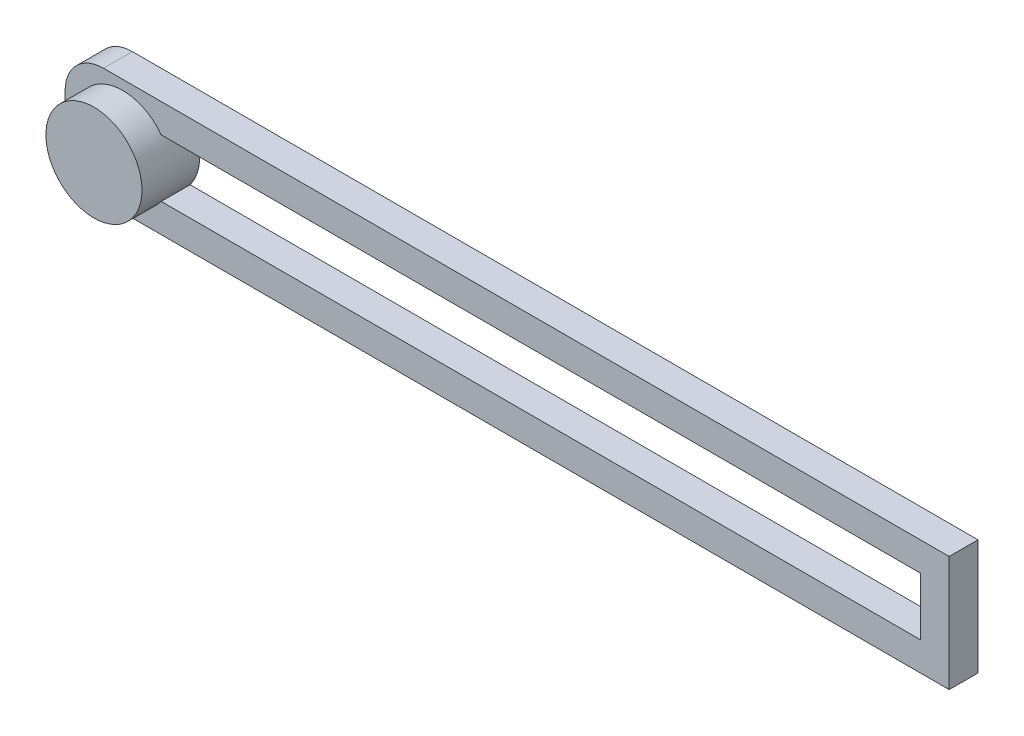
ISO-10303-21;
HEADER;
FILE_DESCRIPTION(('STEP AP214'),'2;1');
FILE_NAME('part.step','',(''),(''),'','','');
FILE_SCHEMA(('AUTOMOTIVE_DESIGN { 1 0 10303 214 1 1 1 1 }'));
ENDSEC;
DATA;
#1=APPLICATION_CONTEXT('core data for automotive mechanical design processes');
#2=APPLICATION_PROTOCOL_DEFINITION('international standard','automotive_design',2000,#1);
#3=PRODUCT_CONTEXT('',#1,'mechanical');
#4=PRODUCT('Part','Part','',(#3));
#5=PRODUCT_RELATED_PRODUCT_CATEGORY('part','',(#4));
#6=PRODUCT_DEFINITION_FORMATION('','',#4);
#7=PRODUCT_DEFINITION_CONTEXT('part definition',#1,'design');
#8=PRODUCT_DEFINITION('design','',#6,#7);
#9=PRODUCT_DEFINITION_SHAPE('','',#8);
#10=(LENGTH_UNIT() NAMED_UNIT(*) SI_UNIT(.MILLI.,.METRE.));
#11=(NAMED_UNIT(*) PLANE_ANGLE_UNIT() SI_UNIT($,.RADIAN.));
#12=(NAMED_UNIT(*) SI_UNIT($,.STERADIAN.) SOLID_ANGLE_UNIT());
#13=UNCERTAINTY_MEASURE_WITH_UNIT(LENGTH_MEASURE(1.E-05),#10,'distance_accuracy_value','');
#14=(GEOMETRIC_REPRESENTATION_CONTEXT(3) GLOBAL_UNCERTAINTY_ASSIGNED_CONTEXT((#13)) GLOBAL_UNIT_ASSIGNED_CONTEXT((#10,
#11,#12)) REPRESENTATION_CONTEXT('',''));
#15=CARTESIAN_POINT('',(0.,0.,0.));
#16=DIRECTION('',(0.,0.,1.));
#17=DIRECTION('',(1.,0.,0.));
#18=AXIS2_PLACEMENT_3D('',#15,#16,#17);
#19=CARTESIAN_POINT('',(46.,-6.,3.));
#20=DIRECTION('',(-1.,0.,0.));
#21=DIRECTION('',(0.,0.,1.));
#22=AXIS2_PLACEMENT_3D('',#19,#20,#21);
#23=PLANE('',#22);
#24=DIRECTION('',(0.,1.,0.));
#25=VECTOR('',#24,1.);
#26=CARTESIAN_POINT('',(46.,-6.,0.));
#27=LINE('',#26,#25);
#28=CARTESIAN_POINT('',(46.,-6.,0.));
#29=VERTEX_POINT('',#28);
#30=CARTESIAN_POINT('',(46.,6.,0.));
#31=VERTEX_POINT('',#30);
#32=EDGE_CURVE('E164',#29,#31,#27,.T.);
#33=ORIENTED_EDGE('',*,*,#32,.T.);
#34=DIRECTION('',(0.,0.,-1.));
#35=VECTOR('',#34,1.);
#36=CARTESIAN_POINT('',(46.,6.,3.));
#37=LINE('',#36,#35);
#38=CARTESIAN_POINT('',(46.,6.,3.));
#39=VERTEX_POINT('',#38);
#40=EDGE_CURVE('E186',#39,#31,#37,.T.);
#41=ORIENTED_EDGE('',*,*,#40,.F.);
#42=DIRECTION('',(0.,1.,0.));
#43=VECTOR('',#42,1.);
#44=CARTESIAN_POINT('',(46.,-6.,3.));
#45=LINE('',#44,#43);
#46=CARTESIAN_POINT('',(46.,-6.,3.));
#47=VERTEX_POINT('',#46);
#48=EDGE_CURVE('E166',#47,#39,#45,.T.);
#49=ORIENTED_EDGE('',*,*,#48,.F.);
#50=DIRECTION('',(0.,0.,-1.));
#51=VECTOR('',#50,1.);
#52=CARTESIAN_POINT('',(46.,-6.,3.));
#53=LINE('',#52,#51);
#54=EDGE_CURVE('E176',#47,#29,#53,.T.);
#55=ORIENTED_EDGE('',*,*,#54,.T.);
#56=EDGE_LOOP('',(#33,#41,#49,#55));
#57=FACE_BOUND('',#56,.T.);
#58=ADVANCED_FACE('F45',(#57),#23,.F.);
#59=CARTESIAN_POINT('',(-46.,6.,3.));
#60=DIRECTION('',(0.,-1.,0.));
#61=DIRECTION('',(0.,0.,-1.));
#62=AXIS2_PLACEMENT_3D('',#59,#60,#61);
#63=PLANE('',#62);
#64=DIRECTION('',(-1.,0.,0.));
#65=VECTOR('',#64,1.);
#66=CARTESIAN_POINT('',(-46.,6.,0.));
#67=LINE('',#66,#65);
#68=CARTESIAN_POINT('',(-42.,6.,0.));
#69=VERTEX_POINT('',#68);
#70=EDGE_CURVE('E179',#31,#69,#67,.T.);
#71=ORIENTED_EDGE('',*,*,#70,.T.);
#72=DIRECTION('',(0.,0.,-1.));
#73=VECTOR('',#72,1.);
#74=CARTESIAN_POINT('',(-42.,6.,3.));
#75=LINE('',#74,#73);
#76=CARTESIAN_POINT('',(-42.,6.,3.));
#77=VERTEX_POINT('',#76);
#78=EDGE_CURVE('E53',#69,#77,#75,.F.);
#79=ORIENTED_EDGE('',*,*,#78,.T.);
#80=DIRECTION('',(-1.,0.,0.));
#81=VECTOR('',#80,1.);
#82=CARTESIAN_POINT('',(-46.,6.,3.));
#83=LINE('',#82,#81);
#84=EDGE_CURVE('E169',#39,#77,#83,.T.);
#85=ORIENTED_EDGE('',*,*,#84,.F.);
#86=ORIENTED_EDGE('',*,*,#40,.T.);
#87=EDGE_LOOP('',(#71,#79,#85,#86));
#88=FACE_BOUND('',#87,.T.);
#89=ADVANCED_FACE('F221',(#88),#63,.F.);
#90=CARTESIAN_POINT('',(-46.,-6.,3.));
#91=DIRECTION('',(1.,0.,0.));
#92=DIRECTION('',(0.,0.,-1.));
#93=AXIS2_PLACEMENT_3D('',#90,#91,#92);
#94=PLANE('',#93);
#95=DIRECTION('',(0.,-1.,0.));
#96=VECTOR('',#95,1.);
#97=CARTESIAN_POINT('',(-46.,-6.,0.));
#98=LINE('',#97,#96);
#99=CARTESIAN_POINT('',(-46.,2.,0.));
#100=VERTEX_POINT('',#99);
#101=CARTESIAN_POINT('',(-46.,-2.,0.));
#102=VERTEX_POINT('',#101);
#103=EDGE_CURVE('E181',#100,#102,#98,.T.);
#104=ORIENTED_EDGE('',*,*,#103,.T.);
#105=DIRECTION('',(0.,0.,-1.));
#106=VECTOR('',#105,1.);
#107=CARTESIAN_POINT('',(-46.,-2.,3.));
#108=LINE('',#107,#106);
#109=CARTESIAN_POINT('',(-46.,-2.,3.));
#110=VERTEX_POINT('',#109);
#111=EDGE_CURVE('E67',#102,#110,#108,.F.);
#112=ORIENTED_EDGE('',*,*,#111,.T.);
#113=DIRECTION('',(0.,-1.,0.));
#114=VECTOR('',#113,1.);
#115=CARTESIAN_POINT('',(-46.,-6.,3.));
#116=LINE('',#115,#114);
#117=CARTESIAN_POINT('',(-46.,2.,3.));
#118=VERTEX_POINT('',#117);
#119=EDGE_CURVE('E172',#118,#110,#116,.T.);
#120=ORIENTED_EDGE('',*,*,#119,.F.);
#121=DIRECTION('',(0.,0.,-1.));
#122=VECTOR('',#121,1.);
#123=CARTESIAN_POINT('',(-46.,2.,3.));
#124=LINE('',#123,#122);
#125=EDGE_CURVE('E196',#118,#100,#124,.T.);
#126=ORIENTED_EDGE('',*,*,#125,.T.);
#127=EDGE_LOOP('',(#104,#112,#120,#126));
#128=FACE_BOUND('',#127,.T.);
#129=ADVANCED_FACE('F217',(#128),#94,.F.);
#130=CARTESIAN_POINT('',(-46.,-6.,3.));
#131=DIRECTION('',(0.,1.,0.));
#132=DIRECTION('',(0.,0.,1.));
#133=AXIS2_PLACEMENT_3D('',#130,#131,#132);
#134=PLANE('',#133);
#135=DIRECTION('',(1.,0.,0.));
#136=VECTOR('',#135,1.);
#137=CARTESIAN_POINT('',(-46.,-6.,3.));
#138=LINE('',#137,#136);
#139=CARTESIAN_POINT('',(-42.,-6.,3.));
#140=VERTEX_POINT('',#139);
#141=EDGE_CURVE('E174',#140,#47,#138,.T.);
#142=ORIENTED_EDGE('',*,*,#141,.F.);
#143=DIRECTION('',(0.,0.,-1.));
#144=VECTOR('',#143,1.);
#145=CARTESIAN_POINT('',(-42.,-6.,3.));
#146=LINE('',#145,#144);
#147=CARTESIAN_POINT('',(-42.,-6.,0.));
#148=VERTEX_POINT('',#147);
#149=EDGE_CURVE('E189',#140,#148,#146,.T.);
#150=ORIENTED_EDGE('',*,*,#149,.T.);
#151=DIRECTION('',(1.,0.,0.));
#152=VECTOR('',#151,1.);
#153=CARTESIAN_POINT('',(-46.,-6.,0.));
#154=LINE('',#153,#152);
#155=EDGE_CURVE('E170',#148,#29,#154,.T.);
#156=ORIENTED_EDGE('',*,*,#155,.T.);
#157=ORIENTED_EDGE('',*,*,#54,.F.);
#158=EDGE_LOOP('',(#142,#150,#156,#157));
#159=FACE_BOUND('',#158,.T.);
#160=ADVANCED_FACE('F211',(#159),#134,.F.);
#161=CARTESIAN_POINT('',(0.,0.,3.));
#162=DIRECTION('',(0.,0.,-1.));
#163=DIRECTION('',(-1.,0.,0.));
#164=AXIS2_PLACEMENT_3D('',#161,#162,#163);
#165=PLANE('',#164);
#166=DIRECTION('',(1.,0.,0.));
#167=VECTOR('',#166,1.);
#168=CARTESIAN_POINT('',(-42.,-3.,3.));
#169=LINE('',#168,#167);
#170=CARTESIAN_POINT('',(-36.,-3.,3.));
#171=VERTEX_POINT('',#170);
#172=CARTESIAN_POINT('',(43.,-3.,3.));
#173=VERTEX_POINT('',#172);
#174=EDGE_CURVE('E158',#171,#173,#169,.T.);
#175=ORIENTED_EDGE('',*,*,#174,.F.);
#176=CARTESIAN_POINT('',(-40.,0.,3.));
#177=DIRECTION('',(0.,0.,-1.));
#178=DIRECTION('',(-1.,0.,0.));
#179=AXIS2_PLACEMENT_3D('',#176,#177,#178);
#180=CIRCLE('',#179,5.);
#181=CARTESIAN_POINT('',(-36.,3.,3.));
#182=VERTEX_POINT('',#181);
#183=EDGE_CURVE('E127',#171,#182,#180,.T.);
#184=ORIENTED_EDGE('',*,*,#183,.T.);
#185=DIRECTION('',(-1.,0.,0.));
#186=VECTOR('',#185,1.);
#187=CARTESIAN_POINT('',(43.,3.,3.));
#188=LINE('',#187,#186);
#189=CARTESIAN_POINT('',(43.,3.,3.));
#190=VERTEX_POINT('',#189);
#191=EDGE_CURVE('E147',#190,#182,#188,.T.);
#192=ORIENTED_EDGE('',*,*,#191,.F.);
#193=DIRECTION('',(0.,1.,0.));
#194=VECTOR('',#193,1.);
#195=CARTESIAN_POINT('',(43.,-3.,3.));
#196=LINE('',#195,#194);
#197=EDGE_CURVE('E151',#173,#190,#196,.T.);
#198=ORIENTED_EDGE('',*,*,#197,.F.);
#199=EDGE_LOOP('',(#175,#184,#192,#198));
#200=FACE_BOUND('',#199,.T.);
#201=ORIENTED_EDGE('',*,*,#119,.T.);
#202=CARTESIAN_POINT('',(-42.,-2.,3.));
#203=DIRECTION('',(0.,0.,-1.));
#204=DIRECTION('',(-1.,0.,0.));
#205=AXIS2_PLACEMENT_3D('',#202,#203,#204);
#206=CIRCLE('',#205,4.);
#207=EDGE_CURVE('E202',#110,#140,#206,.F.);
#208=ORIENTED_EDGE('',*,*,#207,.T.);
#209=ORIENTED_EDGE('',*,*,#141,.T.);
#210=ORIENTED_EDGE('',*,*,#48,.T.);
#211=ORIENTED_EDGE('',*,*,#84,.T.);
#212=CARTESIAN_POINT('',(-42.,2.,3.));
#213=DIRECTION('',(0.,0.,-1.));
#214=DIRECTION('',(-1.,0.,0.));
#215=AXIS2_PLACEMENT_3D('',#212,#213,#214);
#216=CIRCLE('',#215,4.);
#217=EDGE_CURVE('E200',#77,#118,#216,.F.);
#218=ORIENTED_EDGE('',*,*,#217,.T.);
#219=EDGE_LOOP('',(#201,#208,#209,#210,#211,#218));
#220=FACE_BOUND('',#219,.T.);
#221=ADVANCED_FACE('F206',(#200,#220),#165,.F.);
#222=CARTESIAN_POINT('',(0.,0.,0.));
#223=DIRECTION('',(0.,0.,-1.));
#224=DIRECTION('',(-1.,0.,0.));
#225=AXIS2_PLACEMENT_3D('',#222,#223,#224);
#226=PLANE('',#225);
#227=DIRECTION('',(-1.,0.,0.));
#228=VECTOR('',#227,1.);
#229=CARTESIAN_POINT('',(43.,3.,0.));
#230=LINE('',#229,#228);
#231=CARTESIAN_POINT('',(43.,3.,0.));
#232=VERTEX_POINT('',#231);
#233=CARTESIAN_POINT('',(-36.,3.,0.));
#234=VERTEX_POINT('',#233);
#235=EDGE_CURVE('E139',#232,#234,#230,.T.);
#236=ORIENTED_EDGE('',*,*,#235,.T.);
#237=CARTESIAN_POINT('',(-40.,0.,0.));
#238=DIRECTION('',(0.,0.,-1.));
#239=DIRECTION('',(-1.,0.,0.));
#240=AXIS2_PLACEMENT_3D('',#237,#238,#239);
#241=CIRCLE('',#240,5.);
#242=CARTESIAN_POINT('',(-36.,-3.,0.));
#243=VERTEX_POINT('',#242);
#244=EDGE_CURVE('E124',#243,#234,#241,.F.);
#245=ORIENTED_EDGE('',*,*,#244,.F.);
#246=DIRECTION('',(1.,0.,0.));
#247=VECTOR('',#246,1.);
#248=CARTESIAN_POINT('',(-42.,-3.,0.));
#249=LINE('',#248,#247);
#250=CARTESIAN_POINT('',(43.,-3.,0.));
#251=VERTEX_POINT('',#250);
#252=EDGE_CURVE('E136',#243,#251,#249,.T.);
#253=ORIENTED_EDGE('',*,*,#252,.T.);
#254=DIRECTION('',(0.,1.,0.));
#255=VECTOR('',#254,1.);
#256=CARTESIAN_POINT('',(43.,-3.,0.));
#257=LINE('',#256,#255);
#258=EDGE_CURVE('E146',#251,#232,#257,.T.);
#259=ORIENTED_EDGE('',*,*,#258,.T.);
#260=EDGE_LOOP('',(#236,#245,#253,#259));
#261=FACE_BOUND('',#260,.T.);
#262=ORIENTED_EDGE('',*,*,#155,.F.);
#263=CARTESIAN_POINT('',(-42.,-2.,0.));
#264=DIRECTION('',(0.,0.,-1.));
#265=DIRECTION('',(-1.,0.,0.));
#266=AXIS2_PLACEMENT_3D('',#263,#264,#265);
#267=CIRCLE('',#266,4.);
#268=EDGE_CURVE('E194',#148,#102,#267,.T.);
#269=ORIENTED_EDGE('',*,*,#268,.T.);
#270=ORIENTED_EDGE('',*,*,#103,.F.);
#271=CARTESIAN_POINT('',(-42.,2.,0.));
#272=DIRECTION('',(0.,0.,-1.));
#273=DIRECTION('',(-1.,0.,0.));
#274=AXIS2_PLACEMENT_3D('',#271,#272,#273);
#275=CIRCLE('',#274,4.);
#276=EDGE_CURVE('E192',#100,#69,#275,.T.);
#277=ORIENTED_EDGE('',*,*,#276,.T.);
#278=ORIENTED_EDGE('',*,*,#70,.F.);
#279=ORIENTED_EDGE('',*,*,#32,.F.);
#280=EDGE_LOOP('',(#262,#269,#270,#277,#278,#279));
#281=FACE_BOUND('',#280,.T.);
#282=ADVANCED_FACE('F133',(#261,#281),#226,.T.);
#283=CARTESIAN_POINT('',(-42.,-2.,3.));
#284=DIRECTION('',(0.,0.,-1.));
#285=DIRECTION('',(-1.,0.,0.));
#286=AXIS2_PLACEMENT_3D('',#283,#284,#285);
#287=CYLINDRICAL_SURFACE('',#286,4.);
#288=ORIENTED_EDGE('',*,*,#207,.F.);
#289=ORIENTED_EDGE('',*,*,#111,.F.);
#290=ORIENTED_EDGE('',*,*,#268,.F.);
#291=ORIENTED_EDGE('',*,*,#149,.F.);
#292=EDGE_LOOP('',(#288,#289,#290,#291));
#293=FACE_BOUND('',#292,.T.);
#294=ADVANCED_FACE('F214',(#293),#287,.T.);
#295=CARTESIAN_POINT('',(-42.,2.,3.));
#296=DIRECTION('',(0.,0.,-1.));
#297=DIRECTION('',(-1.,0.,0.));
#298=AXIS2_PLACEMENT_3D('',#295,#296,#297);
#299=CYLINDRICAL_SURFACE('',#298,4.);
#300=ORIENTED_EDGE('',*,*,#217,.F.);
#301=ORIENTED_EDGE('',*,*,#78,.F.);
#302=ORIENTED_EDGE('',*,*,#276,.F.);
#303=ORIENTED_EDGE('',*,*,#125,.F.);
#304=EDGE_LOOP('',(#300,#301,#302,#303));
#305=FACE_BOUND('',#304,.T.);
#306=ADVANCED_FACE('F47',(#305),#299,.T.);
#307=CARTESIAN_POINT('',(43.,3.,0.));
#308=DIRECTION('',(0.,1.,0.));
#309=DIRECTION('',(0.,0.,1.));
#310=AXIS2_PLACEMENT_3D('',#307,#308,#309);
#311=PLANE('',#310);
#312=ORIENTED_EDGE('',*,*,#191,.T.);
#313=DIRECTION('',(0.,0.,1.));
#314=VECTOR('',#313,1.);
#315=CARTESIAN_POINT('',(-36.,3.,-14.1421356237309));
#316=LINE('',#315,#314);
#317=EDGE_CURVE('E154',#182,#234,#316,.F.);
#318=ORIENTED_EDGE('',*,*,#317,.T.);
#319=ORIENTED_EDGE('',*,*,#235,.F.);
#320=DIRECTION('',(0.,0.,1.));
#321=VECTOR('',#320,1.);
#322=CARTESIAN_POINT('',(43.,3.,0.));
#323=LINE('',#322,#321);
#324=EDGE_CURVE('E162',#232,#190,#323,.T.);
#325=ORIENTED_EDGE('',*,*,#324,.T.);
#326=EDGE_LOOP('',(#312,#318,#319,#325));
#327=FACE_BOUND('',#326,.T.);
#328=ADVANCED_FACE('F236',(#327),#311,.F.);
#329=CARTESIAN_POINT('',(43.,-3.,0.));
#330=DIRECTION('',(1.,0.,0.));
#331=DIRECTION('',(0.,0.,-1.));
#332=AXIS2_PLACEMENT_3D('',#329,#330,#331);
#333=PLANE('',#332);
#334=ORIENTED_EDGE('',*,*,#197,.T.);
#335=ORIENTED_EDGE('',*,*,#324,.F.);
#336=ORIENTED_EDGE('',*,*,#258,.F.);
#337=DIRECTION('',(0.,0.,1.));
#338=VECTOR('',#337,1.);
#339=CARTESIAN_POINT('',(43.,-3.,0.));
#340=LINE('',#339,#338);
#341=EDGE_CURVE('E144',#251,#173,#340,.T.);
#342=ORIENTED_EDGE('',*,*,#341,.T.);
#343=EDGE_LOOP('',(#334,#335,#336,#342));
#344=FACE_BOUND('',#343,.T.);
#345=ADVANCED_FACE('F292',(#344),#333,.F.);
#346=CARTESIAN_POINT('',(-42.,-3.,0.));
#347=DIRECTION('',(0.,-1.,0.));
#348=DIRECTION('',(1.,0.,0.));
#349=AXIS2_PLACEMENT_3D('',#346,#347,#348);
#350=PLANE('',#349);
#351=ORIENTED_EDGE('',*,*,#252,.F.);
#352=DIRECTION('',(0.,0.,1.));
#353=VECTOR('',#352,1.);
#354=CARTESIAN_POINT('',(-36.,-3.,-14.1421356237309));
#355=LINE('',#354,#353);
#356=EDGE_CURVE('E11',#243,#171,#355,.T.);
#357=ORIENTED_EDGE('',*,*,#356,.T.);
#358=ORIENTED_EDGE('',*,*,#174,.T.);
#359=ORIENTED_EDGE('',*,*,#341,.F.);
#360=EDGE_LOOP('',(#351,#357,#358,#359));
#361=FACE_BOUND('',#360,.T.);
#362=ADVANCED_FACE('F142',(#361),#350,.F.);
#363=CARTESIAN_POINT('',(-40.,0.,-14.1421356237309));
#364=DIRECTION('',(0.,0.,1.));
#365=DIRECTION('',(1.,0.,0.));
#366=AXIS2_PLACEMENT_3D('',#363,#364,#365);
#367=CYLINDRICAL_SURFACE('',#366,5.);
#368=CARTESIAN_POINT('',(-40.,0.,6.));
#369=DIRECTION('',(0.,0.,1.));
#370=DIRECTION('',(1.,0.,0.));
#371=AXIS2_PLACEMENT_3D('',#368,#369,#370);
#372=CIRCLE('',#371,5.);
#373=CARTESIAN_POINT('',(-35.,0.,6.));
#374=VERTEX_POINT('',#373);
#375=EDGE_CURVE('E140',#374,#374,#372,.T.);
#376=ORIENTED_EDGE('',*,*,#375,.F.);
#377=EDGE_LOOP('',(#376));
#378=FACE_BOUND('',#377,.T.);
#379=ORIENTED_EDGE('',*,*,#317,.F.);
#380=ORIENTED_EDGE('',*,*,#183,.F.);
#381=ORIENTED_EDGE('',*,*,#356,.F.);
#382=ORIENTED_EDGE('',*,*,#244,.T.);
#383=EDGE_LOOP('',(#379,#380,#381,#382));
#384=FACE_BOUND('',#383,.T.);
#385=ADVANCED_FACE('F123',(#378,#384),#367,.T.);
#386=CARTESIAN_POINT('',(-40.,0.,6.));
#387=DIRECTION('',(0.,0.,1.));
#388=DIRECTION('',(1.,0.,0.));
#389=AXIS2_PLACEMENT_3D('',#386,#387,#388);
#390=PLANE('',#389);
#391=ORIENTED_EDGE('',*,*,#375,.T.);
#392=EDGE_LOOP('',(#391));
#393=FACE_BOUND('',#392,.T.);
#394=ADVANCED_FACE('F316',(#393),#390,.T.);
#395=CLOSED_SHELL('',(#58,#89,#129,#160,#221,#282,#294,#306,#328,#345,#362,#385,#394));
#396=MANIFOLD_SOLID_BREP('B2',#395);
#397=ADVANCED_BREP_SHAPE_REPRESENTATION('',(#18,#396),#14);
#398=SHAPE_DEFINITION_REPRESENTATION(#9,#397);
ENDSEC;
END-ISO-10303-21;
